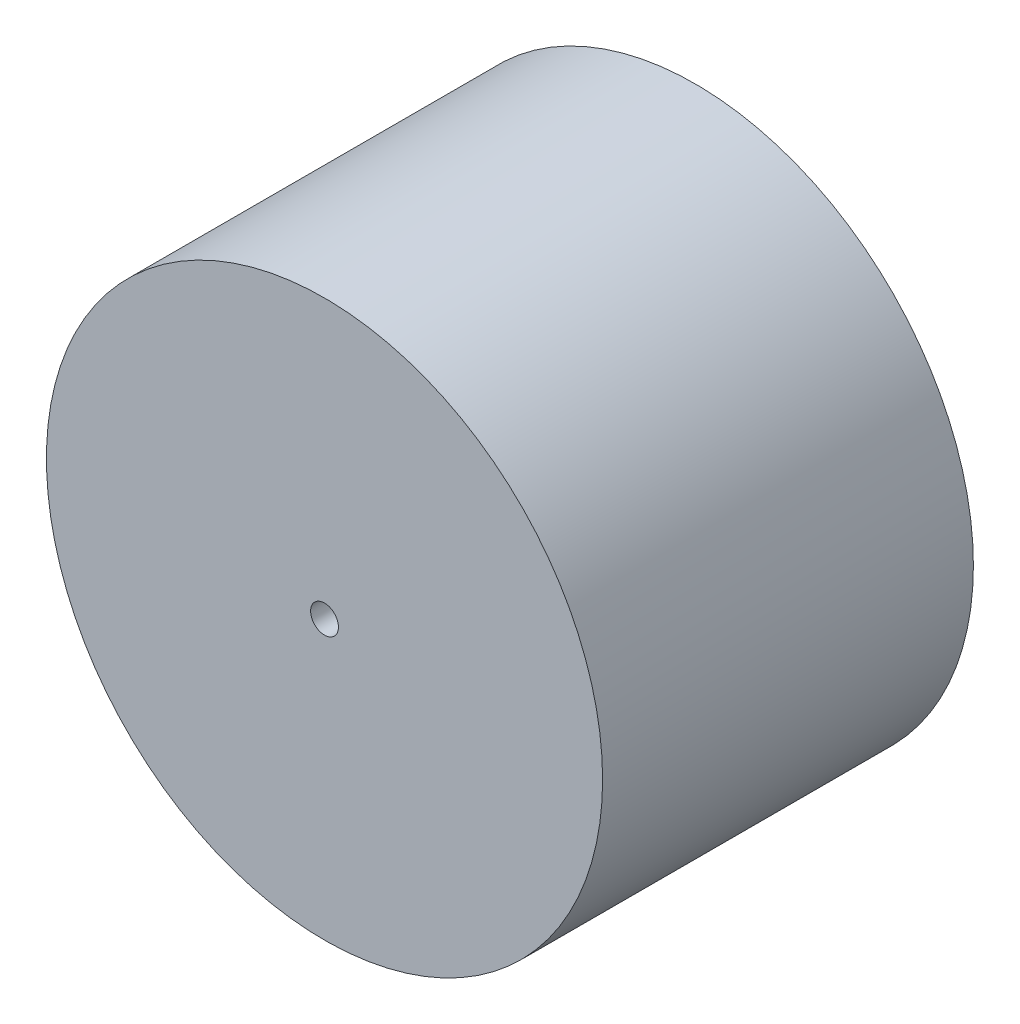
ISO-10303-21;
HEADER;
FILE_DESCRIPTION(('STEP AP214'),'2;1');
FILE_NAME('part.step','',(''),(''),'','','');
FILE_SCHEMA(('AUTOMOTIVE_DESIGN { 1 0 10303 214 1 1 1 1 }'));
ENDSEC;
DATA;
#1=APPLICATION_CONTEXT('core data for automotive mechanical design processes');
#2=APPLICATION_PROTOCOL_DEFINITION('international standard','automotive_design',2000,#1);
#3=PRODUCT_CONTEXT('',#1,'mechanical');
#4=PRODUCT('Part','Part','',(#3));
#5=PRODUCT_RELATED_PRODUCT_CATEGORY('part','',(#4));
#6=PRODUCT_DEFINITION_FORMATION('','',#4);
#7=PRODUCT_DEFINITION_CONTEXT('part definition',#1,'design');
#8=PRODUCT_DEFINITION('design','',#6,#7);
#9=PRODUCT_DEFINITION_SHAPE('','',#8);
#10=(LENGTH_UNIT() NAMED_UNIT(*) SI_UNIT(.MILLI.,.METRE.));
#11=(NAMED_UNIT(*) PLANE_ANGLE_UNIT() SI_UNIT($,.RADIAN.));
#12=(NAMED_UNIT(*) SI_UNIT($,.STERADIAN.) SOLID_ANGLE_UNIT());
#13=UNCERTAINTY_MEASURE_WITH_UNIT(LENGTH_MEASURE(1.E-05),#10,'distance_accuracy_value','');
#14=(GEOMETRIC_REPRESENTATION_CONTEXT(3) GLOBAL_UNCERTAINTY_ASSIGNED_CONTEXT((#13)) GLOBAL_UNIT_ASSIGNED_CONTEXT((#10,
#11,#12)) REPRESENTATION_CONTEXT('',''));
#15=CARTESIAN_POINT('',(0.,0.,0.));
#16=DIRECTION('',(0.,0.,1.));
#17=DIRECTION('',(1.,0.,0.));
#18=AXIS2_PLACEMENT_3D('',#15,#16,#17);
#19=CARTESIAN_POINT('',(0.,0.,40.));
#20=DIRECTION('',(0.,0.,-1.));
#21=DIRECTION('',(-1.,0.,0.));
#22=AXIS2_PLACEMENT_3D('',#19,#20,#21);
#23=CYLINDRICAL_SURFACE('',#22,30.);
#24=CARTESIAN_POINT('',(0.,0.,40.));
#25=DIRECTION('',(0.,0.,1.));
#26=DIRECTION('',(1.,0.,0.));
#27=AXIS2_PLACEMENT_3D('',#24,#25,#26);
#28=CIRCLE('',#27,30.);
#29=CARTESIAN_POINT('',(30.,0.,40.));
#30=VERTEX_POINT('',#29);
#31=EDGE_CURVE('E11',#30,#30,#28,.T.);
#32=ORIENTED_EDGE('',*,*,#31,.F.);
#33=EDGE_LOOP('',(#32));
#34=FACE_BOUND('',#33,.T.);
#35=CARTESIAN_POINT('',(0.,0.,0.));
#36=DIRECTION('',(0.,0.,1.));
#37=DIRECTION('',(1.,0.,0.));
#38=AXIS2_PLACEMENT_3D('',#35,#36,#37);
#39=CIRCLE('',#38,30.);
#40=CARTESIAN_POINT('',(30.,0.,0.));
#41=VERTEX_POINT('',#40);
#42=EDGE_CURVE('E40',#41,#41,#39,.T.);
#43=ORIENTED_EDGE('',*,*,#42,.T.);
#44=EDGE_LOOP('',(#43));
#45=FACE_BOUND('',#44,.T.);
#46=ADVANCED_FACE('F32',(#34,#45),#23,.T.);
#47=CARTESIAN_POINT('',(0.,0.,40.));
#48=DIRECTION('',(0.,0.,1.));
#49=DIRECTION('',(1.,0.,0.));
#50=AXIS2_PLACEMENT_3D('',#47,#48,#49);
#51=PLANE('',#50);
#52=CARTESIAN_POINT('',(0.,0.,40.));
#53=DIRECTION('',(0.,0.,1.));
#54=DIRECTION('',(1.,0.,0.));
#55=AXIS2_PLACEMENT_3D('',#52,#53,#54);
#56=CIRCLE('',#55,1.5);
#57=CARTESIAN_POINT('',(1.5,0.,40.));
#58=VERTEX_POINT('',#57);
#59=EDGE_CURVE('E235',#58,#58,#56,.T.);
#60=ORIENTED_EDGE('',*,*,#59,.F.);
#61=EDGE_LOOP('',(#60));
#62=FACE_BOUND('',#61,.T.);
#63=ORIENTED_EDGE('',*,*,#31,.T.);
#64=EDGE_LOOP('',(#63));
#65=FACE_BOUND('',#64,.T.);
#66=ADVANCED_FACE('F151',(#62,#65),#51,.T.);
#67=CARTESIAN_POINT('',(0.,0.,0.));
#68=DIRECTION('',(0.,0.,1.));
#69=DIRECTION('',(1.,0.,0.));
#70=AXIS2_PLACEMENT_3D('',#67,#68,#69);
#71=PLANE('',#70);
#72=CARTESIAN_POINT('',(0.,0.,0.));
#73=DIRECTION('',(0.,0.,-1.));
#74=DIRECTION('',(-1.,0.,0.));
#75=AXIS2_PLACEMENT_3D('',#72,#73,#74);
#76=CIRCLE('',#75,20.);
#77=CARTESIAN_POINT('',(-20.,0.,0.));
#78=VERTEX_POINT('',#77);
#79=EDGE_CURVE('E134',#78,#78,#76,.T.);
#80=ORIENTED_EDGE('',*,*,#79,.F.);
#81=EDGE_LOOP('',(#80));
#82=FACE_BOUND('',#81,.T.);
#83=ORIENTED_EDGE('',*,*,#42,.F.);
#84=EDGE_LOOP('',(#83));
#85=FACE_BOUND('',#84,.T.);
#86=ADVANCED_FACE('F148',(#82,#85),#71,.F.);
#87=CARTESIAN_POINT('',(0.,0.,25.));
#88=DIRECTION('',(0.,0.,-1.));
#89=DIRECTION('',(-1.,0.,0.));
#90=AXIS2_PLACEMENT_3D('',#87,#88,#89);
#91=CYLINDRICAL_SURFACE('',#90,20.);
#92=CARTESIAN_POINT('',(0.,0.,25.));
#93=DIRECTION('',(0.,0.,-1.));
#94=DIRECTION('',(-1.,0.,0.));
#95=AXIS2_PLACEMENT_3D('',#92,#93,#94);
#96=CIRCLE('',#95,20.);
#97=CARTESIAN_POINT('',(-20.,0.,25.));
#98=VERTEX_POINT('',#97);
#99=EDGE_CURVE('E140',#98,#98,#96,.T.);
#100=ORIENTED_EDGE('',*,*,#99,.F.);
#101=EDGE_LOOP('',(#100));
#102=FACE_BOUND('',#101,.T.);
#103=ORIENTED_EDGE('',*,*,#79,.T.);
#104=EDGE_LOOP('',(#103));
#105=FACE_BOUND('',#104,.T.);
#106=ADVANCED_FACE('F150',(#102,#105),#91,.F.);
#107=CARTESIAN_POINT('',(0.,0.,25.));
#108=DIRECTION('',(0.,0.,-1.));
#109=DIRECTION('',(-1.,0.,0.));
#110=AXIS2_PLACEMENT_3D('',#107,#108,#109);
#111=PLANE('',#110);
#112=DIRECTION('',(-0.974839883963126,0.222906259747811,0.));
#113=VECTOR('',#112,1.);
#114=CARTESIAN_POINT('',(1.76626475026431,-5.73413540404948,25.));
#115=LINE('',#114,#113);
#116=CARTESIAN_POINT('',(1.76626475026431,-5.73413540404948,25.));
#117=VERTEX_POINT('',#116);
#118=CARTESIAN_POINT('',(-4.08277455351444,-4.39669784556262,25.));
#119=VERTEX_POINT('',#118);
#120=EDGE_CURVE('E120',#117,#119,#115,.T.);
#121=ORIENTED_EDGE('',*,*,#120,.F.);
#122=DIRECTION('',(-0.68046242558574,-0.732782974260436,0.));
#123=VECTOR('',#122,1.);
#124=CARTESIAN_POINT('',(5.84903930377875,-1.33743755848686,25.));
#125=LINE('',#124,#123);
#126=CARTESIAN_POINT('',(5.84903930377875,-1.33743755848686,25.));
#127=VERTEX_POINT('',#126);
#128=EDGE_CURVE('E130',#127,#117,#125,.T.);
#129=ORIENTED_EDGE('',*,*,#128,.F.);
#130=DIRECTION('',(0.294377458377386,-0.955689234008247,0.));
#131=VECTOR('',#130,1.);
#132=CARTESIAN_POINT('',(4.08277455351444,4.39669784556262,25.));
#133=LINE('',#132,#131);
#134=CARTESIAN_POINT('',(4.08277455351444,4.39669784556262,25.));
#135=VERTEX_POINT('',#134);
#136=EDGE_CURVE('E48',#135,#127,#133,.T.);
#137=ORIENTED_EDGE('',*,*,#136,.F.);
#138=DIRECTION('',(0.974839883963126,-0.222906259747811,0.));
#139=VECTOR('',#138,1.);
#140=CARTESIAN_POINT('',(-1.76626475026432,5.73413540404948,25.));
#141=LINE('',#140,#139);
#142=CARTESIAN_POINT('',(-1.76626475026432,5.73413540404948,25.));
#143=VERTEX_POINT('',#142);
#144=EDGE_CURVE('E98',#143,#135,#141,.T.);
#145=ORIENTED_EDGE('',*,*,#144,.F.);
#146=DIRECTION('',(0.68046242558574,0.732782974260436,0.));
#147=VECTOR('',#146,1.);
#148=CARTESIAN_POINT('',(-5.84903930377876,1.33743755848687,25.));
#149=LINE('',#148,#147);
#150=CARTESIAN_POINT('',(-5.84903930377876,1.33743755848687,25.));
#151=VERTEX_POINT('',#150);
#152=EDGE_CURVE('E125',#151,#143,#149,.T.);
#153=ORIENTED_EDGE('',*,*,#152,.F.);
#154=DIRECTION('',(-0.294377458377386,0.955689234008247,0.));
#155=VECTOR('',#154,1.);
#156=CARTESIAN_POINT('',(-4.08277455351444,-4.39669784556262,25.));
#157=LINE('',#156,#155);
#158=EDGE_CURVE('E122',#119,#151,#157,.T.);
#159=ORIENTED_EDGE('',*,*,#158,.F.);
#160=EDGE_LOOP('',(#121,#129,#137,#145,#153,#159));
#161=FACE_BOUND('',#160,.T.);
#162=ORIENTED_EDGE('',*,*,#99,.T.);
#163=EDGE_LOOP('',(#162));
#164=FACE_BOUND('',#163,.T.);
#165=ADVANCED_FACE('F157',(#161,#164),#111,.T.);
#166=CARTESIAN_POINT('',(1.76626475026431,-5.73413540404948,30.));
#167=DIRECTION('',(-0.222906259747811,-0.974839883963126,0.));
#168=DIRECTION('',(0.974839883963126,-0.222906259747811,0.));
#169=AXIS2_PLACEMENT_3D('',#166,#167,#168);
#170=PLANE('',#169);
#171=ORIENTED_EDGE('',*,*,#120,.T.);
#172=DIRECTION('',(0.,0.,-1.));
#173=VECTOR('',#172,1.);
#174=CARTESIAN_POINT('',(-4.08277455351444,-4.39669784556262,30.));
#175=LINE('',#174,#173);
#176=CARTESIAN_POINT('',(-4.08277455351444,-4.39669784556262,30.));
#177=VERTEX_POINT('',#176);
#178=EDGE_CURVE('E80',#177,#119,#175,.T.);
#179=ORIENTED_EDGE('',*,*,#178,.F.);
#180=DIRECTION('',(-0.974839883963126,0.222906259747811,0.));
#181=VECTOR('',#180,1.);
#182=CARTESIAN_POINT('',(1.76626475026431,-5.73413540404948,30.));
#183=LINE('',#182,#181);
#184=CARTESIAN_POINT('',(1.76626475026431,-5.73413540404948,30.));
#185=VERTEX_POINT('',#184);
#186=EDGE_CURVE('E132',#185,#177,#183,.T.);
#187=ORIENTED_EDGE('',*,*,#186,.F.);
#188=DIRECTION('',(0.,0.,-1.));
#189=VECTOR('',#188,1.);
#190=CARTESIAN_POINT('',(1.76626475026431,-5.73413540404948,30.));
#191=LINE('',#190,#189);
#192=EDGE_CURVE('E57',#185,#117,#191,.T.);
#193=ORIENTED_EDGE('',*,*,#192,.T.);
#194=EDGE_LOOP('',(#171,#179,#187,#193));
#195=FACE_BOUND('',#194,.T.);
#196=ADVANCED_FACE('F209',(#195),#170,.F.);
#197=CARTESIAN_POINT('',(5.84903930377875,-1.33743755848686,30.));
#198=DIRECTION('',(0.732782974260436,-0.68046242558574,0.));
#199=DIRECTION('',(0.68046242558574,0.732782974260436,0.));
#200=AXIS2_PLACEMENT_3D('',#197,#198,#199);
#201=PLANE('',#200);
#202=ORIENTED_EDGE('',*,*,#128,.T.);
#203=ORIENTED_EDGE('',*,*,#192,.F.);
#204=DIRECTION('',(-0.68046242558574,-0.732782974260436,0.));
#205=VECTOR('',#204,1.);
#206=CARTESIAN_POINT('',(5.84903930377875,-1.33743755848686,30.));
#207=LINE('',#206,#205);
#208=CARTESIAN_POINT('',(5.84903930377875,-1.33743755848686,30.));
#209=VERTEX_POINT('',#208);
#210=EDGE_CURVE('E107',#209,#185,#207,.T.);
#211=ORIENTED_EDGE('',*,*,#210,.F.);
#212=DIRECTION('',(0.,0.,-1.));
#213=VECTOR('',#212,1.);
#214=CARTESIAN_POINT('',(5.84903930377875,-1.33743755848686,30.));
#215=LINE('',#214,#213);
#216=EDGE_CURVE('E99',#209,#127,#215,.T.);
#217=ORIENTED_EDGE('',*,*,#216,.T.);
#218=EDGE_LOOP('',(#202,#203,#211,#217));
#219=FACE_BOUND('',#218,.T.);
#220=ADVANCED_FACE('F206',(#219),#201,.F.);
#221=CARTESIAN_POINT('',(4.08277455351444,4.39669784556262,30.));
#222=DIRECTION('',(0.955689234008247,0.294377458377386,0.));
#223=DIRECTION('',(-0.294377458377386,0.955689234008247,0.));
#224=AXIS2_PLACEMENT_3D('',#221,#222,#223);
#225=PLANE('',#224);
#226=ORIENTED_EDGE('',*,*,#136,.T.);
#227=ORIENTED_EDGE('',*,*,#216,.F.);
#228=DIRECTION('',(0.294377458377386,-0.955689234008247,0.));
#229=VECTOR('',#228,1.);
#230=CARTESIAN_POINT('',(4.08277455351444,4.39669784556262,30.));
#231=LINE('',#230,#229);
#232=CARTESIAN_POINT('',(4.08277455351444,4.39669784556262,30.));
#233=VERTEX_POINT('',#232);
#234=EDGE_CURVE('E103',#233,#209,#231,.T.);
#235=ORIENTED_EDGE('',*,*,#234,.F.);
#236=DIRECTION('',(0.,0.,-1.));
#237=VECTOR('',#236,1.);
#238=CARTESIAN_POINT('',(4.08277455351444,4.39669784556262,30.));
#239=LINE('',#238,#237);
#240=EDGE_CURVE('E91',#233,#135,#239,.T.);
#241=ORIENTED_EDGE('',*,*,#240,.T.);
#242=EDGE_LOOP('',(#226,#227,#235,#241));
#243=FACE_BOUND('',#242,.T.);
#244=ADVANCED_FACE('F104',(#243),#225,.F.);
#245=CARTESIAN_POINT('',(-1.76626475026432,5.73413540404948,30.));
#246=DIRECTION('',(0.222906259747811,0.974839883963126,0.));
#247=DIRECTION('',(-0.974839883963126,0.222906259747811,0.));
#248=AXIS2_PLACEMENT_3D('',#245,#246,#247);
#249=PLANE('',#248);
#250=ORIENTED_EDGE('',*,*,#144,.T.);
#251=ORIENTED_EDGE('',*,*,#240,.F.);
#252=DIRECTION('',(0.974839883963126,-0.222906259747811,0.));
#253=VECTOR('',#252,1.);
#254=CARTESIAN_POINT('',(-1.76626475026432,5.73413540404948,30.));
#255=LINE('',#254,#253);
#256=CARTESIAN_POINT('',(-1.76626475026432,5.73413540404948,30.));
#257=VERTEX_POINT('',#256);
#258=EDGE_CURVE('E95',#257,#233,#255,.T.);
#259=ORIENTED_EDGE('',*,*,#258,.F.);
#260=DIRECTION('',(0.,0.,-1.));
#261=VECTOR('',#260,1.);
#262=CARTESIAN_POINT('',(-1.76626475026432,5.73413540404948,30.));
#263=LINE('',#262,#261);
#264=EDGE_CURVE('E100',#257,#143,#263,.T.);
#265=ORIENTED_EDGE('',*,*,#264,.T.);
#266=EDGE_LOOP('',(#250,#251,#259,#265));
#267=FACE_BOUND('',#266,.T.);
#268=ADVANCED_FACE('F93',(#267),#249,.F.);
#269=CARTESIAN_POINT('',(-5.84903930377876,1.33743755848687,30.));
#270=DIRECTION('',(-0.732782974260436,0.68046242558574,0.));
#271=DIRECTION('',(-0.68046242558574,-0.732782974260436,0.));
#272=AXIS2_PLACEMENT_3D('',#269,#270,#271);
#273=PLANE('',#272);
#274=ORIENTED_EDGE('',*,*,#152,.T.);
#275=ORIENTED_EDGE('',*,*,#264,.F.);
#276=DIRECTION('',(0.68046242558574,0.732782974260436,0.));
#277=VECTOR('',#276,1.);
#278=CARTESIAN_POINT('',(-5.84903930377876,1.33743755848687,30.));
#279=LINE('',#278,#277);
#280=CARTESIAN_POINT('',(-5.84903930377876,1.33743755848687,30.));
#281=VERTEX_POINT('',#280);
#282=EDGE_CURVE('E113',#281,#257,#279,.T.);
#283=ORIENTED_EDGE('',*,*,#282,.F.);
#284=DIRECTION('',(0.,0.,-1.));
#285=VECTOR('',#284,1.);
#286=CARTESIAN_POINT('',(-5.84903930377876,1.33743755848687,30.));
#287=LINE('',#286,#285);
#288=EDGE_CURVE('E137',#281,#151,#287,.T.);
#289=ORIENTED_EDGE('',*,*,#288,.T.);
#290=EDGE_LOOP('',(#274,#275,#283,#289));
#291=FACE_BOUND('',#290,.T.);
#292=ADVANCED_FACE('F214',(#291),#273,.F.);
#293=CARTESIAN_POINT('',(-4.08277455351444,-4.39669784556262,30.));
#294=DIRECTION('',(-0.955689234008247,-0.294377458377386,0.));
#295=DIRECTION('',(0.294377458377386,-0.955689234008247,0.));
#296=AXIS2_PLACEMENT_3D('',#293,#294,#295);
#297=PLANE('',#296);
#298=ORIENTED_EDGE('',*,*,#158,.T.);
#299=ORIENTED_EDGE('',*,*,#288,.F.);
#300=DIRECTION('',(-0.294377458377386,0.955689234008247,0.));
#301=VECTOR('',#300,1.);
#302=CARTESIAN_POINT('',(-4.08277455351444,-4.39669784556262,30.));
#303=LINE('',#302,#301);
#304=EDGE_CURVE('E115',#177,#281,#303,.T.);
#305=ORIENTED_EDGE('',*,*,#304,.F.);
#306=ORIENTED_EDGE('',*,*,#178,.T.);
#307=EDGE_LOOP('',(#298,#299,#305,#306));
#308=FACE_BOUND('',#307,.T.);
#309=ADVANCED_FACE('F180',(#308),#297,.F.);
#310=CARTESIAN_POINT('',(0.,0.,30.));
#311=DIRECTION('',(0.,0.,-1.));
#312=DIRECTION('',(-1.,0.,0.));
#313=AXIS2_PLACEMENT_3D('',#310,#311,#312);
#314=PLANE('',#313);
#315=CARTESIAN_POINT('',(0.,0.,30.));
#316=DIRECTION('',(0.,0.,-1.));
#317=DIRECTION('',(-1.,0.,0.));
#318=AXIS2_PLACEMENT_3D('',#315,#316,#317);
#319=CIRCLE('',#318,1.5);
#320=CARTESIAN_POINT('',(-1.5,0.,30.));
#321=VERTEX_POINT('',#320);
#322=EDGE_CURVE('E35',#321,#321,#319,.T.);
#323=ORIENTED_EDGE('',*,*,#322,.F.);
#324=EDGE_LOOP('',(#323));
#325=FACE_BOUND('',#324,.T.);
#326=ORIENTED_EDGE('',*,*,#186,.T.);
#327=ORIENTED_EDGE('',*,*,#304,.T.);
#328=ORIENTED_EDGE('',*,*,#282,.T.);
#329=ORIENTED_EDGE('',*,*,#258,.T.);
#330=ORIENTED_EDGE('',*,*,#234,.T.);
#331=ORIENTED_EDGE('',*,*,#210,.T.);
#332=EDGE_LOOP('',(#326,#327,#328,#329,#330,#331));
#333=FACE_BOUND('',#332,.T.);
#334=ADVANCED_FACE('F110',(#325,#333),#314,.T.);
#335=CARTESIAN_POINT('',(0.,0.,0.));
#336=DIRECTION('',(0.,0.,1.));
#337=DIRECTION('',(1.,0.,0.));
#338=AXIS2_PLACEMENT_3D('',#335,#336,#337);
#339=CYLINDRICAL_SURFACE('',#338,1.5);
#340=ORIENTED_EDGE('',*,*,#322,.T.);
#341=EDGE_LOOP('',(#340));
#342=FACE_BOUND('',#341,.T.);
#343=ORIENTED_EDGE('',*,*,#59,.T.);
#344=EDGE_LOOP('',(#343));
#345=FACE_BOUND('',#344,.T.);
#346=ADVANCED_FACE('F189',(#342,#345),#339,.F.);
#347=CLOSED_SHELL('',(#46,#66,#86,#106,#165,#196,#220,#244,#268,#292,#309,#334,#346));
#348=MANIFOLD_SOLID_BREP('B2',#347);
#349=ADVANCED_BREP_SHAPE_REPRESENTATION('',(#18,#348),#14);
#350=SHAPE_DEFINITION_REPRESENTATION(#9,#349);
ENDSEC;
END-ISO-10303-21;
